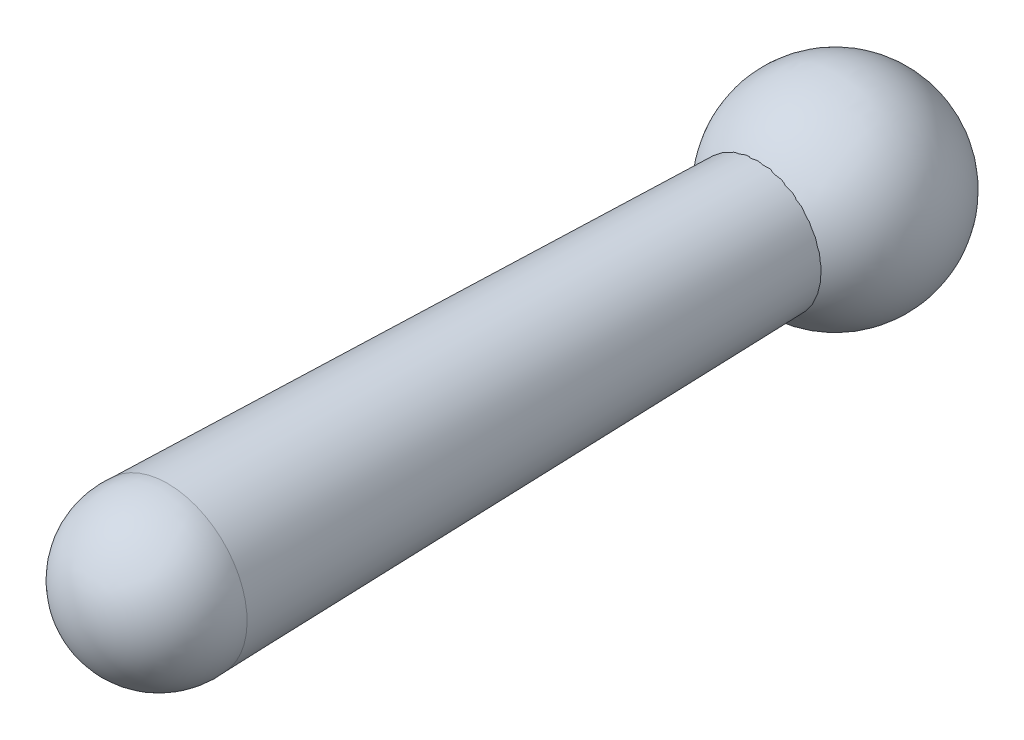
ISO-10303-21;
HEADER;
FILE_DESCRIPTION(('STEP AP214'),'2;1');
FILE_NAME('part.step','',(''),(''),'','','');
FILE_SCHEMA(('AUTOMOTIVE_DESIGN { 1 0 10303 214 1 1 1 1 }'));
ENDSEC;
DATA;
#1=APPLICATION_CONTEXT('core data for automotive mechanical design processes');
#2=APPLICATION_PROTOCOL_DEFINITION('international standard','automotive_design',2000,#1);
#3=PRODUCT_CONTEXT('',#1,'mechanical');
#4=PRODUCT('Part','Part','',(#3));
#5=PRODUCT_RELATED_PRODUCT_CATEGORY('part','',(#4));
#6=PRODUCT_DEFINITION_FORMATION('','',#4);
#7=PRODUCT_DEFINITION_CONTEXT('part definition',#1,'design');
#8=PRODUCT_DEFINITION('design','',#6,#7);
#9=PRODUCT_DEFINITION_SHAPE('','',#8);
#10=(LENGTH_UNIT() NAMED_UNIT(*) SI_UNIT(.MILLI.,.METRE.));
#11=(NAMED_UNIT(*) PLANE_ANGLE_UNIT() SI_UNIT($,.RADIAN.));
#12=(NAMED_UNIT(*) SI_UNIT($,.STERADIAN.) SOLID_ANGLE_UNIT());
#13=UNCERTAINTY_MEASURE_WITH_UNIT(LENGTH_MEASURE(1.E-05),#10,'distance_accuracy_value','');
#14=(GEOMETRIC_REPRESENTATION_CONTEXT(3) GLOBAL_UNCERTAINTY_ASSIGNED_CONTEXT((#13)) GLOBAL_UNIT_ASSIGNED_CONTEXT((#10,
#11,#12)) REPRESENTATION_CONTEXT('',''));
#15=CARTESIAN_POINT('',(0.,0.,0.));
#16=DIRECTION('',(0.,0.,1.));
#17=DIRECTION('',(1.,0.,0.));
#18=AXIS2_PLACEMENT_3D('',#15,#16,#17);
#19=CARTESIAN_POINT('',(0.,0.,1.73770418376762));
#20=DIRECTION('',(0.,0.,-1.));
#21=DIRECTION('',(0.,1.,0.));
#22=AXIS2_PLACEMENT_3D('',#19,#20,#21);
#23=CONICAL_SURFACE('',#22,0.,0.922971354154149);
#24=CARTESIAN_POINT('',(0.,0.,0.748275348997604));
#25=DIRECTION('',(0.,0.,-1.));
#26=DIRECTION('',(0.,1.,0.));
#27=AXIS2_PLACEMENT_3D('',#24,#25,#26);
#28=CIRCLE('',#27,1.30742272667523);
#29=CARTESIAN_POINT('',(0.,1.30742272667523,0.748275348997604));
#30=VERTEX_POINT('',#29);
#31=EDGE_CURVE('P0_E11',#30,#30,#28,.T.);
#32=ORIENTED_EDGE('',*,*,#31,.T.);
#33=EDGE_LOOP('',(#32));
#34=FACE_BOUND('',#33,.T.);
#35=CARTESIAN_POINT('',(0.,0.,1.73770418376762));
#36=VERTEX_POINT('',#35);
#37=VERTEX_LOOP('',#36);
#38=FACE_BOUND('',#37,.T.);
#39=ADVANCED_FACE('P0_F33',(#34,#38),#23,.F.);
#40=CARTESIAN_POINT('',(0.,0.,0.748275348997604));
#41=DIRECTION('',(0.,0.,1.));
#42=DIRECTION('',(0.,-1.,0.));
#43=AXIS2_PLACEMENT_3D('',#40,#41,#42);
#44=CONICAL_SURFACE('',#43,1.30742272667523,0.0261799387799151);
#45=CARTESIAN_POINT('',(0.,0.,13.8689620667436));
#46=DIRECTION('',(0.,0.,-1.));
#47=DIRECTION('',(0.,1.,0.));
#48=AXIS2_PLACEMENT_3D('',#45,#46,#47);
#49=CIRCLE('',#48,1.651);
#50=CARTESIAN_POINT('',(0.,1.651,13.8689620667436));
#51=VERTEX_POINT('',#50);
#52=EDGE_CURVE('P0_E39',#51,#51,#49,.T.);
#53=ORIENTED_EDGE('',*,*,#52,.T.);
#54=EDGE_LOOP('',(#53));
#55=FACE_BOUND('',#54,.T.);
#56=ORIENTED_EDGE('',*,*,#31,.F.);
#57=EDGE_LOOP('',(#56));
#58=FACE_BOUND('',#57,.T.);
#59=ADVANCED_FACE('P0_F43',(#55,#58),#44,.T.);
#60=CARTESIAN_POINT('',(0.,0.,14.0471196144639));
#61=DIRECTION('',(0.,0.,-1.));
#62=DIRECTION('',(0.,1.,0.));
#63=AXIS2_PLACEMENT_3D('',#60,#61,#62);
#64=SPHERICAL_SURFACE('',#63,1.66058456930374);
#65=ORIENTED_EDGE('',*,*,#52,.F.);
#66=EDGE_LOOP('',(#65));
#67=FACE_BOUND('',#66,.T.);
#68=ADVANCED_FACE('P0_F48',(#67),#64,.T.);
#69=CLOSED_SHELL('',(#39,#59,#68));
#70=MANIFOLD_SOLID_BREP('P0_B2',#69);
#71=CARTESIAN_POINT('',(0.,0.,0.));
#72=DIRECTION('',(1.,0.,0.));
#73=DIRECTION('',(0.,1.,0.));
#74=AXIS2_PLACEMENT_3D('',#71,#72,#73);
#75=SPHERICAL_SURFACE('',#74,2.1);
#76=CARTESIAN_POINT('',(-2.1,0.,0.));
#77=VERTEX_POINT('',#76);
#78=VERTEX_LOOP('',#77);
#79=FACE_BOUND('',#78,.T.);
#80=CARTESIAN_POINT('',(2.1,0.,0.));
#81=VERTEX_POINT('',#80);
#82=VERTEX_LOOP('',#81);
#83=FACE_BOUND('',#82,.T.);
#84=CARTESIAN_POINT('',(0.,0.,1.73770418376762));
#85=DIRECTION('',(0.,0.,1.));
#86=DIRECTION('',(0.,-1.,0.));
#87=AXIS2_PLACEMENT_3D('',#84,#85,#86);
#88=CIRCLE('',#87,1.17914552518672);
#89=CARTESIAN_POINT('',(0.,-1.17914552518671,1.73770418376762));
#90=VERTEX_POINT('',#89);
#91=EDGE_CURVE('P1_E13',#90,#90,#88,.F.);
#92=ORIENTED_EDGE('',*,*,#91,.T.);
#93=EDGE_LOOP('',(#92));
#94=FACE_BOUND('',#93,.T.);
#95=ADVANCED_FACE('P1_F25',(#79,#83,#94),#75,.T.);
#96=CARTESIAN_POINT('',(0.,0.,7.33324826302351));
#97=DIRECTION('',(0.,0.,1.));
#98=DIRECTION('',(0.,-1.,0.));
#99=AXIS2_PLACEMENT_3D('',#96,#97,#98);
#100=CONICAL_SURFACE('',#99,1.33739797981036,0.0282743338500801);
#101=CARTESIAN_POINT('',(0.,0.,7.33324826319404));
#102=DIRECTION('',(0.,0.,1.));
#103=DIRECTION('',(-1.,0.,0.));
#104=AXIS2_PLACEMENT_3D('',#101,#102,#103);
#105=CIRCLE('',#104,1.33739797981569);
#106=CARTESIAN_POINT('',(-1.33739797981569,0.,7.33324826319404));
#107=VERTEX_POINT('',#106);
#108=EDGE_CURVE('P1_E31',#107,#107,#105,.F.);
#109=ORIENTED_EDGE('',*,*,#108,.T.);
#110=EDGE_LOOP('',(#109));
#111=FACE_BOUND('',#110,.T.);
#112=ORIENTED_EDGE('',*,*,#91,.F.);
#113=EDGE_LOOP('',(#112));
#114=FACE_BOUND('',#113,.T.);
#115=ADVANCED_FACE('P1_F39',(#111,#114),#100,.T.);
#116=CARTESIAN_POINT('',(0.,0.,7.36999999999999));
#117=DIRECTION('',(0.,0.,1.));
#118=DIRECTION('',(0.,-1.,0.));
#119=AXIS2_PLACEMENT_3D('',#116,#117,#118);
#120=DEGENERATE_TOROIDAL_SURFACE('',#119,0.0379175801083857,1.30000000000001,.T.);
#121=ORIENTED_EDGE('',*,*,#108,.F.);
#122=EDGE_LOOP('',(#121));
#123=FACE_BOUND('',#122,.T.);
#124=CARTESIAN_POINT('',(0.,0.,8.67));
#125=DIRECTION('',(0.,0.,-1.));
#126=DIRECTION('',(-1.,0.,0.));
#127=AXIS2_PLACEMENT_3D('',#124,#125,#126);
#128=CIRCLE('',#127,0.0379175801084143);
#129=CARTESIAN_POINT('',(-0.0379175801084143,0.,8.67));
#130=VERTEX_POINT('',#129);
#131=EDGE_CURVE('P1_E55',#130,#130,#128,.T.);
#132=ORIENTED_EDGE('',*,*,#131,.T.);
#133=EDGE_LOOP('',(#132));
#134=FACE_BOUND('',#133,.T.);
#135=ADVANCED_FACE('P1_F26',(#123,#134),#120,.T.);
#136=OPEN_SHELL('',(#95,#115,#135));
#137=SHELL_BASED_SURFACE_MODEL('P1_B1',(#136));
#138=ADVANCED_BREP_SHAPE_REPRESENTATION('',(#18,#70),#14);
#139=MANIFOLD_SURFACE_SHAPE_REPRESENTATION('',(#18,#137),#14);
#140=SHAPE_REPRESENTATION('',(#18),#14);
#141=SHAPE_DEFINITION_REPRESENTATION(#9,#140);
#142=SHAPE_REPRESENTATION_RELATIONSHIP('','',#140,#138);
#143=SHAPE_REPRESENTATION_RELATIONSHIP('','',#140,#139);
ENDSEC;
END-ISO-10303-21;
